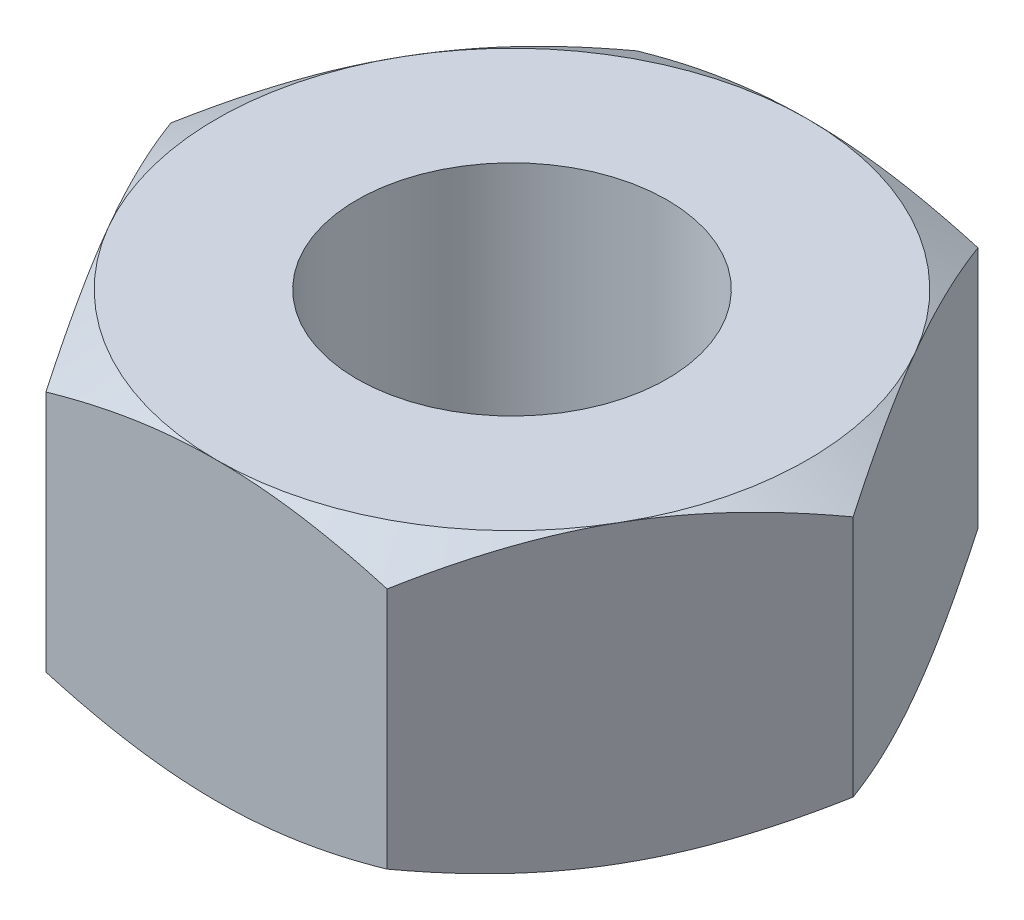
ISO-10303-21;
HEADER;
FILE_DESCRIPTION(('STEP AP214'),'2;1');
FILE_NAME('part.step','',(''),(''),'','','');
FILE_SCHEMA(('AUTOMOTIVE_DESIGN { 1 0 10303 214 1 1 1 1 }'));
ENDSEC;
DATA;
#1=APPLICATION_CONTEXT('core data for automotive mechanical design processes');
#2=APPLICATION_PROTOCOL_DEFINITION('international standard','automotive_design',2000,#1);
#3=PRODUCT_CONTEXT('',#1,'mechanical');
#4=PRODUCT('Part','Part','',(#3));
#5=PRODUCT_RELATED_PRODUCT_CATEGORY('part','',(#4));
#6=PRODUCT_DEFINITION_FORMATION('','',#4);
#7=PRODUCT_DEFINITION_CONTEXT('part definition',#1,'design');
#8=PRODUCT_DEFINITION('design','',#6,#7);
#9=PRODUCT_DEFINITION_SHAPE('','',#8);
#10=(LENGTH_UNIT() NAMED_UNIT(*) SI_UNIT(.MILLI.,.METRE.));
#11=(NAMED_UNIT(*) PLANE_ANGLE_UNIT() SI_UNIT($,.RADIAN.));
#12=(NAMED_UNIT(*) SI_UNIT($,.STERADIAN.) SOLID_ANGLE_UNIT());
#13=UNCERTAINTY_MEASURE_WITH_UNIT(LENGTH_MEASURE(1.E-05),#10,'distance_accuracy_value','');
#14=(GEOMETRIC_REPRESENTATION_CONTEXT(3) GLOBAL_UNCERTAINTY_ASSIGNED_CONTEXT((#13)) GLOBAL_UNIT_ASSIGNED_CONTEXT((#10,
#11,#12)) REPRESENTATION_CONTEXT('',''));
#15=CARTESIAN_POINT('',(0.,0.,0.));
#16=DIRECTION('',(0.,0.,1.));
#17=DIRECTION('',(1.,0.,0.));
#18=AXIS2_PLACEMENT_3D('',#15,#16,#17);
#19=CARTESIAN_POINT('',(0.,0.,0.));
#20=DIRECTION('',(0.,1.,0.));
#21=DIRECTION('',(0.,0.,1.));
#22=AXIS2_PLACEMENT_3D('',#19,#20,#21);
#23=PLANE('',#22);
#24=CARTESIAN_POINT('',(0.,0.,0.));
#25=DIRECTION('',(0.,1.,0.));
#26=DIRECTION('',(0.,0.,1.));
#27=AXIS2_PLACEMENT_3D('',#24,#25,#26);
#28=CIRCLE('',#27,2.1);
#29=CARTESIAN_POINT('',(0.,0.,2.1));
#30=VERTEX_POINT('',#29);
#31=EDGE_CURVE('E151',#30,#30,#28,.T.);
#32=ORIENTED_EDGE('',*,*,#31,.T.);
#33=EDGE_LOOP('',(#32));
#34=FACE_BOUND('',#33,.T.);
#35=CARTESIAN_POINT('',(0.,0.,0.));
#36=DIRECTION('',(0.,1.,0.));
#37=DIRECTION('',(0.,0.,1.));
#38=AXIS2_PLACEMENT_3D('',#35,#36,#37);
#39=CIRCLE('',#38,4.);
#40=CARTESIAN_POINT('',(3.46410161513776,0.,2.));
#41=VERTEX_POINT('',#40);
#42=CARTESIAN_POINT('',(0.,0.,4.));
#43=VERTEX_POINT('',#42);
#44=EDGE_CURVE('E280',#41,#43,#39,.F.);
#45=ORIENTED_EDGE('',*,*,#44,.T.);
#46=CARTESIAN_POINT('',(-3.46410161513775,0.,2.));
#47=VERTEX_POINT('',#46);
#48=EDGE_CURVE('E279',#43,#47,#39,.F.);
#49=ORIENTED_EDGE('',*,*,#48,.T.);
#50=CARTESIAN_POINT('',(-3.46410161513776,0.,-2.));
#51=VERTEX_POINT('',#50);
#52=EDGE_CURVE('E156',#47,#51,#39,.F.);
#53=ORIENTED_EDGE('',*,*,#52,.T.);
#54=CARTESIAN_POINT('',(0.,0.,-4.));
#55=VERTEX_POINT('',#54);
#56=EDGE_CURVE('E130',#51,#55,#39,.F.);
#57=ORIENTED_EDGE('',*,*,#56,.T.);
#58=CARTESIAN_POINT('',(0.,0.,0.));
#59=DIRECTION('',(0.,-1.,0.));
#60=DIRECTION('',(0.,0.,-1.));
#61=AXIS2_PLACEMENT_3D('',#58,#59,#60);
#62=CIRCLE('',#61,4.);
#63=CARTESIAN_POINT('',(3.46410161513775,0.,-2.));
#64=VERTEX_POINT('',#63);
#65=EDGE_CURVE('E142',#55,#64,#62,.T.);
#66=ORIENTED_EDGE('',*,*,#65,.T.);
#67=EDGE_CURVE('E157',#64,#41,#39,.F.);
#68=ORIENTED_EDGE('',*,*,#67,.T.);
#69=EDGE_LOOP('',(#45,#49,#53,#57,#66,#68));
#70=FACE_BOUND('',#69,.T.);
#71=ADVANCED_FACE('F35',(#34,#70),#23,.F.);
#72=CARTESIAN_POINT('',(0.,1.01165529752684,0.));
#73=DIRECTION('',(0.,1.,0.));
#74=DIRECTION('',(0.,0.,1.));
#75=AXIS2_PLACEMENT_3D('',#72,#73,#74);
#76=CONICAL_SURFACE('',#75,5.75223837506273,1.0471975511966);
#77=ORIENTED_EDGE('',*,*,#44,.F.);
#78=CARTESIAN_POINT('',(2.30928560670466,0.357332259074763,4.0002));
#79=CARTESIAN_POINT('',(2.4107717464617,0.298717873648279,3.82442084967677));
#80=CARTESIAN_POINT('',(2.51313390883499,0.245410321462259,3.64712438367362));
#81=CARTESIAN_POINT('',(2.71963072479811,0.152361670746401,3.28946140682429));
#82=CARTESIAN_POINT('',(2.82376904741904,0.112653489029702,3.10908854102985));
#83=CARTESIAN_POINT('',(3.03075510011795,0.0508422152802777,2.75057818129721));
#84=CARTESIAN_POINT('',(3.13357098372491,0.0283277315228874,2.57249584706486));
#85=CARTESIAN_POINT('',(3.33968651028528,0.00145062314658053,2.21549328283349));
#86=CARTESIAN_POINT('',(3.44298540411434,-0.0029342585730579,2.0365743503559));
#87=CARTESIAN_POINT('',(3.63600352522932,0.00619007293996886,1.70225715780327));
#88=CARTESIAN_POINT('',(3.72575165335064,0.0174589539879925,1.54680884001294));
#89=CARTESIAN_POINT('',(3.90466320392054,0.0531739907981907,1.23692494436495));
#90=CARTESIAN_POINT('',(3.99382600759478,0.0776323457115302,1.08249043825587));
#91=CARTESIAN_POINT('',(4.17310641015197,0.138776064919286,0.771967672225422));
#92=CARTESIAN_POINT('',(4.26320131938131,0.17572060365486,0.615918711936897));
#93=CARTESIAN_POINT('',(4.4420474282755,0.259570072548023,0.30614816459616));
#94=CARTESIAN_POINT('',(4.53080091904966,0.306455302212736,0.15242260922622));
#95=CARTESIAN_POINT('',(4.61891762357084,0.357332259074762,-0.000200000000000818));
#96=B_SPLINE_CURVE_WITH_KNOTS('',3,(#78,#79,#80,#81,#82,#83,#84,#85,#86,#87,#88,#89,#90,#91,#92,
#93,#94,#95),.UNSPECIFIED.,.F.,.F.,(4,2,2,2,2,2,2,2,4),(0.,0.634047835695965,1.26961969224543,
1.88946157213122,2.50854226669297,3.04757825393385,3.58711366126903,4.13861653143764,
4.68903648037743),.UNSPECIFIED.);
#97=CARTESIAN_POINT('',(2.3094010767585,0.357265589908158,4.));
#98=VERTEX_POINT('',#97);
#99=EDGE_CURVE('E257',#98,#41,#96,.T.);
#100=ORIENTED_EDGE('',*,*,#99,.F.);
#101=CARTESIAN_POINT('',(-6.21610382945253,1.95830505255475,4.));
#102=CARTESIAN_POINT('',(-6.04129393753383,1.87345531470294,4.));
#103=CARTESIAN_POINT('',(-5.866084134719,1.78941544477169,4.));
#104=CARTESIAN_POINT('',(-5.51465209675861,1.62341065326267,4.));
#105=CARTESIAN_POINT('',(-5.33842970851649,1.54144605615205,4.));
#106=CARTESIAN_POINT('',(-4.98385801778069,1.37963737506261,4.));
#107=CARTESIAN_POINT('',(-4.8055023669303,1.29980715444459,4.));
#108=CARTESIAN_POINT('',(-4.44737699770602,1.14339646321227,4.));
#109=CARTESIAN_POINT('',(-4.26760734622888,1.06681583994185,4.));
#110=CARTESIAN_POINT('',(-3.90050810678963,0.915343870654523,4.));
#111=CARTESIAN_POINT('',(-3.71312239199081,0.840587811222979,4.));
#112=CARTESIAN_POINT('',(-3.3361633261642,0.696702657851749,4.));
#113=CARTESIAN_POINT('',(-3.14658973299501,0.62757419369362,4.));
#114=CARTESIAN_POINT('',(-2.76530411727324,0.496749654124006,4.));
#115=CARTESIAN_POINT('',(-2.57359727178235,0.435038641169028,4.));
#116=CARTESIAN_POINT('',(-2.18743348201238,0.321020872537668,4.));
#117=CARTESIAN_POINT('',(-1.99297742073436,0.268711168154121,4.));
#118=CARTESIAN_POINT('',(-1.60229161070312,0.176278338862026,4.));
#119=CARTESIAN_POINT('',(-1.40607796776608,0.136088389516055,4.));
#120=CARTESIAN_POINT('',(-1.01119696707465,0.0701558498648354,4.));
#121=CARTESIAN_POINT('',(-0.812529846459926,0.0444118742889818,4.));
#122=CARTESIAN_POINT('',(-0.416334271672849,0.00976143621869423,4.));
#123=CARTESIAN_POINT('',(-0.218825312568516,0.00063755988438352,4.));
#124=CARTESIAN_POINT('',(0.17626120125344,-0.000572186093219584,4.));
#125=CARTESIAN_POINT('',(0.373838757050768,0.00734222584564285,4.));
#126=CARTESIAN_POINT('',(0.70889189743754,0.0346497891926858,4.));
#127=CARTESIAN_POINT('',(0.846724424757143,0.0499172637070026,4.));
#128=CARTESIAN_POINT('',(1.12138280851754,0.0878005320879427,4.));
#129=CARTESIAN_POINT('',(1.25820852697945,0.110417314648067,4.));
#130=CARTESIAN_POINT('',(1.6669925458922,0.188103177465333,4.));
#131=CARTESIAN_POINT('',(1.93710530269367,0.252993698033655,4.));
#132=CARTESIAN_POINT('',(2.34100258449655,0.365542277663182,4.));
#133=CARTESIAN_POINT('',(2.47688023904443,0.406116926927529,4.));
#134=CARTESIAN_POINT('',(2.7473156995193,0.491487455346763,4.));
#135=CARTESIAN_POINT('',(2.88187349674704,0.53628336230362,4.));
#136=CARTESIAN_POINT('',(3.14971162021589,0.629376977397762,4.));
#137=CARTESIAN_POINT('',(3.28299235003583,0.677673534961568,4.));
#138=CARTESIAN_POINT('',(3.54844920627366,0.777199578240249,4.));
#139=CARTESIAN_POINT('',(3.68062534546055,0.828429029997131,4.));
#140=CARTESIAN_POINT('',(3.99176962227722,0.952363485660557,4.));
#141=CARTESIAN_POINT('',(4.17031907349587,1.0261176679972,4.));
#142=CARTESIAN_POINT('',(4.52590076029498,1.17720690942518,4.));
#143=CARTESIAN_POINT('',(4.7029329041339,1.25454218325646,4.));
#144=CARTESIAN_POINT('',(5.05575838858236,1.41207616475093,4.));
#145=CARTESIAN_POINT('',(5.23155146986776,1.49227545169641,4.));
#146=CARTESIAN_POINT('',(5.5820735849472,1.65497001304965,4.));
#147=CARTESIAN_POINT('',(5.75680259574338,1.73746533686873,4.));
#148=CARTESIAN_POINT('',(6.28000491494065,1.98789188019563,4.));
#149=CARTESIAN_POINT('',(6.62714536888524,2.15860603665389,4.));
#150=CARTESIAN_POINT('',(7.31891008279937,2.50505668842854,4.));
#151=CARTESIAN_POINT('',(7.66353424898847,2.6807933697438,4.));
#152=CARTESIAN_POINT('',(8.32215325819648,3.02096699537072,4.));
#153=CARTESIAN_POINT('',(8.63629620049669,3.18511773748744,4.));
#154=CARTESIAN_POINT('',(9.26340755269146,3.51567071485497,4.));
#155=CARTESIAN_POINT('',(9.57637592053283,3.68207302975468,4.));
#156=CARTESIAN_POINT('',(10.2006123381608,4.01617620516382,4.));
#157=CARTESIAN_POINT('',(10.5118826823662,4.18387278436308,4.));
#158=CARTESIAN_POINT('',(11.1336717290461,4.52061326666315,4.));
#159=CARTESIAN_POINT('',(11.4441904722528,4.6896570945188,4.));
#160=CARTESIAN_POINT('',(11.7544324444447,4.85920367105242,4.));
#161=B_SPLINE_CURVE_WITH_KNOTS('',3,(#101,#102,#103,#104,#105,#106,#107,#108,#109,#110,#111,
#112,#113,#114,#115,#116,#117,#118,#119,#120,#121,#122,#123,#124,#125,#126,#127,#128,#129,#130,
#131,#132,#133,#134,#135,#136,#137,#138,#139,#140,#141,#142,#143,#144,#145,#146,#147,#148,#149,
#150,#151,#152,#153,#154,#155,#156,#157,#158,#159,#160),.UNSPECIFIED.,.F.,.F.,(4,2,2,2,2,2,2,2,
2,2,2,2,2,2,2,2,2,2,2,2,2,2,2,2,2,2,2,2,2,4),(0.,0.582949414006017,1.1659894157665,
1.75218219754288,2.33834741122659,2.94351871374663,3.54875764787039,4.15275654833507,
4.75656567352277,5.35698201449384,5.95734076977911,6.54978800544378,7.14224503222404,
7.55807008352397,7.97395109843927,8.80617021055455,9.23155305928882,9.65693870986772,
10.0821851756723,10.5074267188319,11.0869224481941,11.6664529720976,12.2461013846533,
12.8257622810584,13.9862303010348,15.1467413523853,16.2100642679783,17.2734248972432,
18.3341296550054,19.394775580824),.UNSPECIFIED.);
#162=EDGE_CURVE('E251',#43,#98,#161,.T.);
#163=ORIENTED_EDGE('',*,*,#162,.F.);
#164=EDGE_LOOP('',(#77,#100,#163));
#165=FACE_BOUND('',#164,.T.);
#166=ADVANCED_FACE('F283',(#165),#76,.T.);
#167=ORIENTED_EDGE('',*,*,#67,.F.);
#168=CARTESIAN_POINT('',(4.61891762357084,0.357332259074762,0.00019999999999875));
#169=CARTESIAN_POINT('',(4.5174314838138,0.298717873648278,-0.175579150323229));
#170=CARTESIAN_POINT('',(4.41506932144051,0.245410321462259,-0.352875616326382));
#171=CARTESIAN_POINT('',(4.20857250547739,0.152361670746401,-0.710538593175707));
#172=CARTESIAN_POINT('',(4.10443418285647,0.112653489029702,-0.890911458970151));
#173=CARTESIAN_POINT('',(3.89744813015756,0.0508422152802777,-1.24942181870279));
#174=CARTESIAN_POINT('',(3.79463224655059,0.0283277315228878,-1.42750415293514));
#175=CARTESIAN_POINT('',(3.58851671999023,0.00145062314658105,-1.78450671716651));
#176=CARTESIAN_POINT('',(3.48521782616117,-0.00293425857305755,-1.9634256496441));
#177=CARTESIAN_POINT('',(3.29219970504619,0.00619007293996924,-2.29774284219673));
#178=CARTESIAN_POINT('',(3.20245157692486,0.017458953987993,-2.45319115998706));
#179=CARTESIAN_POINT('',(3.02354002635497,0.0531739907981915,-2.76307505563505));
#180=CARTESIAN_POINT('',(2.93437722268072,0.0776323457115311,-2.91750956174413));
#181=CARTESIAN_POINT('',(2.75509682012354,0.138776064919287,-3.22803232777458));
#182=CARTESIAN_POINT('',(2.6650019108942,0.17572060365486,-3.3840812880631));
#183=CARTESIAN_POINT('',(2.48615580200001,0.259570072548023,-3.69385183540384));
#184=CARTESIAN_POINT('',(2.39740231122585,0.306455302212736,-3.84757739077378));
#185=CARTESIAN_POINT('',(2.30928560670466,0.357332259074763,-4.0002));
#186=B_SPLINE_CURVE_WITH_KNOTS('',3,(#168,#169,#170,#171,#172,#173,#174,#175,#176,#177,#178,
#179,#180,#181,#182,#183,#184,#185),.UNSPECIFIED.,.F.,.F.,(4,2,2,2,2,2,2,2,4),(0.,
0.634047835695965,1.26961969224543,1.88946157213122,2.50854226669297,3.04757825393385,
3.58711366126903,4.13861653143763,4.68903648037743),.UNSPECIFIED.);
#187=CARTESIAN_POINT('',(4.618802153517,0.357265589908158,0.));
#188=VERTEX_POINT('',#187);
#189=EDGE_CURVE('E163',#188,#64,#186,.T.);
#190=ORIENTED_EDGE('',*,*,#189,.F.);
#191=EDGE_CURVE('E258',#41,#188,#96,.T.);
#192=ORIENTED_EDGE('',*,*,#191,.F.);
#193=EDGE_LOOP('',(#167,#190,#192));
#194=FACE_BOUND('',#193,.T.);
#195=ADVANCED_FACE('F351',(#194),#76,.T.);
#196=ORIENTED_EDGE('',*,*,#65,.F.);
#197=CARTESIAN_POINT('',(-6.21610382945253,1.95830505255475,-4.));
#198=CARTESIAN_POINT('',(-6.04129393753383,1.87345531470294,-4.));
#199=CARTESIAN_POINT('',(-5.866084134719,1.78941544477169,-4.));
#200=CARTESIAN_POINT('',(-5.51465209675861,1.62341065326267,-4.));
#201=CARTESIAN_POINT('',(-5.33842970851649,1.54144605615205,-4.));
#202=CARTESIAN_POINT('',(-4.98385801778069,1.37963737506261,-4.));
#203=CARTESIAN_POINT('',(-4.8055023669303,1.29980715444459,-4.));
#204=CARTESIAN_POINT('',(-4.44737699770602,1.14339646321227,-4.));
#205=CARTESIAN_POINT('',(-4.26760734622888,1.06681583994185,-4.));
#206=CARTESIAN_POINT('',(-3.90050810678963,0.915343870654523,-4.));
#207=CARTESIAN_POINT('',(-3.71312239199081,0.840587811222979,-4.));
#208=CARTESIAN_POINT('',(-3.3361633261642,0.696702657851749,-4.));
#209=CARTESIAN_POINT('',(-3.14658973299501,0.62757419369362,-4.));
#210=CARTESIAN_POINT('',(-2.76530411727324,0.496749654124006,-4.));
#211=CARTESIAN_POINT('',(-2.57359727178235,0.435038641169028,-4.));
#212=CARTESIAN_POINT('',(-2.18743348201238,0.321020872537668,-4.));
#213=CARTESIAN_POINT('',(-1.99297742073436,0.268711168154121,-4.));
#214=CARTESIAN_POINT('',(-1.60229161070312,0.176278338862026,-4.));
#215=CARTESIAN_POINT('',(-1.40607796776608,0.136088389516055,-4.));
#216=CARTESIAN_POINT('',(-1.01119696707465,0.0701558498648354,-4.));
#217=CARTESIAN_POINT('',(-0.812529846459926,0.0444118742889818,-4.));
#218=CARTESIAN_POINT('',(-0.416334271672849,0.00976143621869424,-4.));
#219=CARTESIAN_POINT('',(-0.218825312568516,0.000637559884383533,-4.));
#220=CARTESIAN_POINT('',(0.17626120125344,-0.000572186093219575,-4.));
#221=CARTESIAN_POINT('',(0.373838757050768,0.00734222584564286,-4.));
#222=CARTESIAN_POINT('',(0.70889189743754,0.0346497891926858,-4.));
#223=CARTESIAN_POINT('',(0.846724424757143,0.0499172637070026,-4.));
#224=CARTESIAN_POINT('',(1.12138280851754,0.0878005320879427,-4.));
#225=CARTESIAN_POINT('',(1.25820852697945,0.110417314648067,-4.));
#226=CARTESIAN_POINT('',(1.6669925458922,0.188103177465333,-4.));
#227=CARTESIAN_POINT('',(1.93710530269367,0.252993698033655,-4.));
#228=CARTESIAN_POINT('',(2.34100258449655,0.365542277663182,-4.));
#229=CARTESIAN_POINT('',(2.47688023904443,0.406116926927529,-4.));
#230=CARTESIAN_POINT('',(2.7473156995193,0.491487455346763,-4.));
#231=CARTESIAN_POINT('',(2.88187349674704,0.53628336230362,-4.));
#232=CARTESIAN_POINT('',(3.14971162021589,0.629376977397762,-4.));
#233=CARTESIAN_POINT('',(3.28299235003583,0.677673534961568,-4.));
#234=CARTESIAN_POINT('',(3.54844920627366,0.777199578240249,-4.));
#235=CARTESIAN_POINT('',(3.68062534546055,0.828429029997131,-4.));
#236=CARTESIAN_POINT('',(3.99176962227722,0.952363485660557,-4.));
#237=CARTESIAN_POINT('',(4.17031907349587,1.0261176679972,-4.));
#238=CARTESIAN_POINT('',(4.52590076029498,1.17720690942518,-4.));
#239=CARTESIAN_POINT('',(4.7029329041339,1.25454218325646,-4.));
#240=CARTESIAN_POINT('',(5.05575838858236,1.41207616475093,-4.));
#241=CARTESIAN_POINT('',(5.23155146986776,1.49227545169641,-4.));
#242=CARTESIAN_POINT('',(5.5820735849472,1.65497001304965,-4.));
#243=CARTESIAN_POINT('',(5.75680259574338,1.73746533686873,-4.));
#244=CARTESIAN_POINT('',(6.28000491494065,1.98789188019563,-4.));
#245=CARTESIAN_POINT('',(6.62714536888524,2.15860603665389,-4.));
#246=CARTESIAN_POINT('',(7.31891008279937,2.50505668842854,-4.));
#247=CARTESIAN_POINT('',(7.66353424898847,2.6807933697438,-4.));
#248=CARTESIAN_POINT('',(8.32215325819648,3.02096699537072,-4.));
#249=CARTESIAN_POINT('',(8.63629620049669,3.18511773748743,-4.));
#250=CARTESIAN_POINT('',(9.26340755269146,3.51567071485497,-4.));
#251=CARTESIAN_POINT('',(9.57637592053283,3.68207302975468,-4.));
#252=CARTESIAN_POINT('',(10.2006123381608,4.01617620516382,-4.));
#253=CARTESIAN_POINT('',(10.5118826823662,4.18387278436307,-4.));
#254=CARTESIAN_POINT('',(11.1336717290461,4.52061326666314,-4.));
#255=CARTESIAN_POINT('',(11.4441904722528,4.6896570945188,-4.));
#256=CARTESIAN_POINT('',(11.7544324444447,4.85920367105242,-4.));
#257=B_SPLINE_CURVE_WITH_KNOTS('',3,(#197,#198,#199,#200,#201,#202,#203,#204,#205,#206,#207,
#208,#209,#210,#211,#212,#213,#214,#215,#216,#217,#218,#219,#220,#221,#222,#223,#224,#225,#226,
#227,#228,#229,#230,#231,#232,#233,#234,#235,#236,#237,#238,#239,#240,#241,#242,#243,#244,#245,
#246,#247,#248,#249,#250,#251,#252,#253,#254,#255,#256),.UNSPECIFIED.,.F.,.F.,(4,2,2,2,2,2,2,2,
2,2,2,2,2,2,2,2,2,2,2,2,2,2,2,2,2,2,2,2,2,4),(0.,0.582949414006017,1.1659894157665,
1.75218219754288,2.33834741122659,2.94351871374663,3.54875764787039,4.15275654833507,
4.75656567352277,5.35698201449384,5.95734076977911,6.54978800544378,7.14224503222404,
7.55807008352397,7.97395109843927,8.80617021055455,9.23155305928882,9.65693870986772,
10.0821851756723,10.5074267188319,11.0869224481941,11.6664529720976,12.2461013846533,
12.8257622810584,13.9862303010348,15.1467413523853,16.2100642679783,17.2734248972432,
18.3341296550054,19.394775580824),.UNSPECIFIED.);
#258=CARTESIAN_POINT('',(2.3094010767585,0.357265589908158,-4.));
#259=VERTEX_POINT('',#258);
#260=EDGE_CURVE('E138',#259,#55,#257,.F.);
#261=ORIENTED_EDGE('',*,*,#260,.F.);
#262=EDGE_CURVE('E145',#64,#259,#186,.T.);
#263=ORIENTED_EDGE('',*,*,#262,.F.);
#264=EDGE_LOOP('',(#196,#261,#263));
#265=FACE_BOUND('',#264,.T.);
#266=ADVANCED_FACE('F143',(#265),#76,.T.);
#267=ORIENTED_EDGE('',*,*,#56,.F.);
#268=CARTESIAN_POINT('',(-2.30928560670466,0.357332259074763,-4.0002));
#269=CARTESIAN_POINT('',(-2.4107717464617,0.298717873648279,-3.82442084967677));
#270=CARTESIAN_POINT('',(-2.51313390883499,0.245410321462259,-3.64712438367362));
#271=CARTESIAN_POINT('',(-2.71963072479811,0.152361670746401,-3.28946140682429));
#272=CARTESIAN_POINT('',(-2.82376904741904,0.112653489029702,-3.10908854102985));
#273=CARTESIAN_POINT('',(-3.03075510011795,0.0508422152802777,-2.75057818129721));
#274=CARTESIAN_POINT('',(-3.13357098372491,0.0283277315228874,-2.57249584706486));
#275=CARTESIAN_POINT('',(-3.33968651028528,0.00145062314658052,-2.21549328283349));
#276=CARTESIAN_POINT('',(-3.44298540411434,-0.00293425857305787,-2.0365743503559));
#277=CARTESIAN_POINT('',(-3.63600352522932,0.00619007293996884,-1.70225715780327));
#278=CARTESIAN_POINT('',(-3.72575165335064,0.0174589539879924,-1.54680884001294));
#279=CARTESIAN_POINT('',(-3.90466320392054,0.0531739907981906,-1.23692494436495));
#280=CARTESIAN_POINT('',(-3.99382600759478,0.0776323457115302,-1.08249043825587));
#281=CARTESIAN_POINT('',(-4.17310641015197,0.138776064919286,-0.771967672225423));
#282=CARTESIAN_POINT('',(-4.26320131938131,0.17572060365486,-0.615918711936898));
#283=CARTESIAN_POINT('',(-4.4420474282755,0.259570072548023,-0.306148164596161));
#284=CARTESIAN_POINT('',(-4.53080091904966,0.306455302212735,-0.152422609226221));
#285=CARTESIAN_POINT('',(-4.61891762357084,0.357332259074762,0.000199999999999958));
#286=B_SPLINE_CURVE_WITH_KNOTS('',3,(#268,#269,#270,#271,#272,#273,#274,#275,#276,#277,#278,
#279,#280,#281,#282,#283,#284,#285),.UNSPECIFIED.,.F.,.F.,(4,2,2,2,2,2,2,2,4),(0.,
0.634047835695965,1.26961969224543,1.88946157213122,2.50854226669297,3.04757825393385,
3.58711366126903,4.13861653143763,4.68903648037743),.UNSPECIFIED.);
#287=CARTESIAN_POINT('',(-2.3094010767585,0.357265589908158,-4.));
#288=VERTEX_POINT('',#287);
#289=EDGE_CURVE('E133',#288,#51,#286,.T.);
#290=ORIENTED_EDGE('',*,*,#289,.F.);
#291=EDGE_CURVE('E126',#55,#288,#257,.F.);
#292=ORIENTED_EDGE('',*,*,#291,.F.);
#293=EDGE_LOOP('',(#267,#290,#292));
#294=FACE_BOUND('',#293,.T.);
#295=ADVANCED_FACE('F128',(#294),#76,.T.);
#296=CARTESIAN_POINT('',(-4.618802153517,0.357265589908158,0.));
#297=VERTEX_POINT('',#296);
#298=EDGE_CURVE('E171',#51,#297,#286,.T.);
#299=ORIENTED_EDGE('',*,*,#298,.F.);
#300=ORIENTED_EDGE('',*,*,#52,.F.);
#301=CARTESIAN_POINT('',(-4.61891762357084,0.357332259074762,-0.000199999999999181));
#302=CARTESIAN_POINT('',(-4.5174314838138,0.298717873648279,0.175579150323229));
#303=CARTESIAN_POINT('',(-4.41506932144051,0.245410321462259,0.352875616326381));
#304=CARTESIAN_POINT('',(-4.20857250547739,0.152361670746401,0.710538593175706));
#305=CARTESIAN_POINT('',(-4.10443418285647,0.112653489029702,0.890911458970151));
#306=CARTESIAN_POINT('',(-3.89744813015756,0.0508422152802777,1.24942181870279));
#307=CARTESIAN_POINT('',(-3.79463224655059,0.0283277315228877,1.42750415293514));
#308=CARTESIAN_POINT('',(-3.58851671999023,0.00145062314658097,1.78450671716651));
#309=CARTESIAN_POINT('',(-3.48521782616117,-0.00293425857305751,1.9634256496441));
#310=CARTESIAN_POINT('',(-3.29219970504619,0.0061900729399694,2.29774284219673));
#311=CARTESIAN_POINT('',(-3.20245157692486,0.0174589539879932,2.45319115998706));
#312=CARTESIAN_POINT('',(-3.02354002635497,0.0531739907981915,2.76307505563505));
#313=CARTESIAN_POINT('',(-2.93437722268073,0.077632345711531,2.91750956174413));
#314=CARTESIAN_POINT('',(-2.75509682012354,0.138776064919287,3.22803232777458));
#315=CARTESIAN_POINT('',(-2.6650019108942,0.17572060365486,3.3840812880631));
#316=CARTESIAN_POINT('',(-2.48615580200001,0.259570072548023,3.69385183540384));
#317=CARTESIAN_POINT('',(-2.39740231122585,0.306455302212736,3.84757739077378));
#318=CARTESIAN_POINT('',(-2.30928560670466,0.357332259074762,4.0002));
#319=B_SPLINE_CURVE_WITH_KNOTS('',3,(#301,#302,#303,#304,#305,#306,#307,#308,#309,#310,#311,
#312,#313,#314,#315,#316,#317,#318),.UNSPECIFIED.,.F.,.F.,(4,2,2,2,2,2,2,2,4),(0.,
0.634047835695965,1.26961969224543,1.88946157213122,2.50854226669297,3.04757825393385,
3.58711366126903,4.13861653143763,4.68903648037743),.UNSPECIFIED.);
#320=EDGE_CURVE('E267',#297,#47,#319,.T.);
#321=ORIENTED_EDGE('',*,*,#320,.F.);
#322=EDGE_LOOP('',(#299,#300,#321));
#323=FACE_BOUND('',#322,.T.);
#324=ADVANCED_FACE('F181',(#323),#76,.T.);
#325=ORIENTED_EDGE('',*,*,#48,.F.);
#326=CARTESIAN_POINT('',(-2.30940107675904,0.357265589907797,4.));
#327=VERTEX_POINT('',#326);
#328=EDGE_CURVE('E256',#327,#43,#161,.T.);
#329=ORIENTED_EDGE('',*,*,#328,.F.);
#330=EDGE_CURVE('E262',#47,#327,#319,.T.);
#331=ORIENTED_EDGE('',*,*,#330,.F.);
#332=EDGE_LOOP('',(#325,#329,#331));
#333=FACE_BOUND('',#332,.T.);
#334=ADVANCED_FACE('F278',(#333),#76,.T.);
#335=CARTESIAN_POINT('',(-4.618802153517,4.,0.));
#336=DIRECTION('',(0.866025403784439,0.,-0.5));
#337=DIRECTION('',(-0.5,0.,-0.866025403784439));
#338=AXIS2_PLACEMENT_3D('',#335,#336,#337);
#339=PLANE('',#338);
#340=DIRECTION('',(0.,-1.,0.));
#341=VECTOR('',#340,1.);
#342=CARTESIAN_POINT('',(-2.3094010767585,4.,4.));
#343=LINE('',#342,#341);
#344=CARTESIAN_POINT('',(-2.3094010767585,3.64273441009184,4.));
#345=VERTEX_POINT('',#344);
#346=EDGE_CURVE('E276',#345,#327,#343,.T.);
#347=ORIENTED_EDGE('',*,*,#346,.F.);
#348=CARTESIAN_POINT('',(-2.30928560670466,3.64266774092524,4.0002));
#349=CARTESIAN_POINT('',(-2.4107717464617,3.70128212635172,3.82442084967677));
#350=CARTESIAN_POINT('',(-2.51313390883499,3.75458967853774,3.64712438367362));
#351=CARTESIAN_POINT('',(-2.71963072479811,3.8476383292536,3.28946140682429));
#352=CARTESIAN_POINT('',(-2.82376904741904,3.8873465109703,3.10908854102985));
#353=CARTESIAN_POINT('',(-3.03075510011795,3.94915778471972,2.75057818129721));
#354=CARTESIAN_POINT('',(-3.13357098372491,3.97167226847711,2.57249584706486));
#355=CARTESIAN_POINT('',(-3.33968651028528,3.99854937685342,2.21549328283349));
#356=CARTESIAN_POINT('',(-3.44298540411434,4.00293425857306,2.0365743503559));
#357=CARTESIAN_POINT('',(-3.63600352522932,3.99380992706003,1.70225715780327));
#358=CARTESIAN_POINT('',(-3.72575165335064,3.98254104601201,1.54680884001294));
#359=CARTESIAN_POINT('',(-3.90466320392054,3.94682600920181,1.23692494436495));
#360=CARTESIAN_POINT('',(-3.99382600759478,3.92236765428847,1.08249043825587));
#361=CARTESIAN_POINT('',(-4.17310641015197,3.86122393508071,0.771967672225423));
#362=CARTESIAN_POINT('',(-4.26320131938131,3.82427939634514,0.615918711936899));
#363=CARTESIAN_POINT('',(-4.4420474282755,3.74042992745198,0.306148164596162));
#364=CARTESIAN_POINT('',(-4.53080091904966,3.69354469778726,0.152422609226222));
#365=CARTESIAN_POINT('',(-4.61891762357084,3.64266774092524,-0.000199999999999226));
#366=B_SPLINE_CURVE_WITH_KNOTS('',3,(#348,#349,#350,#351,#352,#353,#354,#355,#356,#357,#358,
#359,#360,#361,#362,#363,#364,#365),.UNSPECIFIED.,.F.,.F.,(4,2,2,2,2,2,2,2,4),(0.,
0.634047835695966,1.26961969224543,1.88946157213122,2.50854226669297,3.04757825393385,
3.58711366126903,4.13861653143763,4.68903648037743),.UNSPECIFIED.);
#367=CARTESIAN_POINT('',(-3.46410161513775,4.,2.));
#368=VERTEX_POINT('',#367);
#369=EDGE_CURVE('E308',#345,#368,#366,.T.);
#370=ORIENTED_EDGE('',*,*,#369,.T.);
#371=CARTESIAN_POINT('',(-4.618802153517,3.64273441009184,0.));
#372=VERTEX_POINT('',#371);
#373=EDGE_CURVE('E52',#368,#372,#366,.T.);
#374=ORIENTED_EDGE('',*,*,#373,.T.);
#375=DIRECTION('',(0.,-1.,0.));
#376=VECTOR('',#375,1.);
#377=CARTESIAN_POINT('',(-4.618802153517,4.,0.));
#378=LINE('',#377,#376);
#379=EDGE_CURVE('E294',#372,#297,#378,.T.);
#380=ORIENTED_EDGE('',*,*,#379,.T.);
#381=ORIENTED_EDGE('',*,*,#320,.T.);
#382=ORIENTED_EDGE('',*,*,#330,.T.);
#383=EDGE_LOOP('',(#347,#370,#374,#380,#381,#382));
#384=FACE_BOUND('',#383,.T.);
#385=ADVANCED_FACE('F37',(#384),#339,.F.);
#386=CARTESIAN_POINT('',(-2.3094010767585,4.,4.));
#387=DIRECTION('',(0.,0.,-1.));
#388=DIRECTION('',(-1.,0.,0.));
#389=AXIS2_PLACEMENT_3D('',#386,#387,#388);
#390=PLANE('',#389);
#391=DIRECTION('',(0.,-1.,0.));
#392=VECTOR('',#391,1.);
#393=CARTESIAN_POINT('',(2.3094010767585,4.,4.));
#394=LINE('',#393,#392);
#395=CARTESIAN_POINT('',(2.3094010767585,3.64273441009184,4.));
#396=VERTEX_POINT('',#395);
#397=EDGE_CURVE('E285',#396,#98,#394,.T.);
#398=ORIENTED_EDGE('',*,*,#397,.F.);
#399=CARTESIAN_POINT('',(-6.24559162206515,2.02736827641668,4.));
#400=CARTESIAN_POINT('',(-6.07053072470974,2.11245754672313,4.));
#401=CARTESIAN_POINT('',(-5.89507248347885,2.19674310533894,4.));
#402=CARTESIAN_POINT('',(-5.5431501793354,2.36325562938496,4.));
#403=CARTESIAN_POINT('',(-5.36668596695165,2.44548227856087,4.));
#404=CARTESIAN_POINT('',(-5.01165145493025,2.60783051789407,4.));
#405=CARTESIAN_POINT('',(-4.83307494451207,2.68793857202682,4.));
#406=CARTESIAN_POINT('',(-4.47451635710505,2.844932547916,4.));
#407=CARTESIAN_POINT('',(-4.29453434575151,2.92181861908049,4.));
#408=CARTESIAN_POINT('',(-3.92689943014578,3.07399439893625,4.));
#409=CARTESIAN_POINT('',(-3.73918960970108,3.14914734601058,4.));
#410=CARTESIAN_POINT('',(-3.36158947801015,3.29386703994031,4.));
#411=CARTESIAN_POINT('',(-3.17169892702165,3.36343316574773,4.));
#412=CARTESIAN_POINT('',(-2.78977728546009,3.49518384774197,4.));
#413=CARTESIAN_POINT('',(-2.59775127723347,3.55738299084263,4.));
#414=CARTESIAN_POINT('',(-2.21094474266055,3.67243170678816,4.));
#415=CARTESIAN_POINT('',(-2.01616509120753,3.72528418024869,4.));
#416=CARTESIAN_POINT('',(-1.62483570564712,3.81884605269263,4.));
#417=CARTESIAN_POINT('',(-1.42830245636267,3.85962314349864,4.));
#418=CARTESIAN_POINT('',(-1.03274780636574,3.92676179688866,4.));
#419=CARTESIAN_POINT('',(-0.833726654878614,3.95312479175255,4.));
#420=CARTESIAN_POINT('',(-0.436806981088597,3.98898880616065,4.));
#421=CARTESIAN_POINT('',(-0.238928842480005,3.99870985150853,4.));
#422=CARTESIAN_POINT('',(0.156945971364149,4.00104762473598,4.));
#423=CARTESIAN_POINT('',(0.354942648071117,3.99366413570467,4.));
#424=CARTESIAN_POINT('',(0.689842719804897,3.96723588795238,4.));
#425=CARTESIAN_POINT('',(0.827099149156393,3.9523969765354,4.));
#426=CARTESIAN_POINT('',(1.10062876450089,3.91540054947087,4.));
#427=CARTESIAN_POINT('',(1.23690181910569,3.89324207370548,4.));
#428=CARTESIAN_POINT('',(1.64405300226765,3.81694961577272,4.));
#429=CARTESIAN_POINT('',(1.91311573549682,3.75301180336916,4.));
#430=CARTESIAN_POINT('',(2.31548446689272,3.6418700249766,4.));
#431=CARTESIAN_POINT('',(2.45086915477515,3.60176050466832,4.));
#432=CARTESIAN_POINT('',(2.72032405669936,3.51730713312694,4.));
#433=CARTESIAN_POINT('',(2.85439426188535,3.47296325338819,4.));
#434=CARTESIAN_POINT('',(3.12126124142953,3.38075842449949,4.));
#435=CARTESIAN_POINT('',(3.25405840338579,3.3328985869421,4.));
#436=CARTESIAN_POINT('',(3.51854800887852,3.23423168698405,4.));
#437=CARTESIAN_POINT('',(3.65024046670658,3.18342466277872,4.));
#438=CARTESIAN_POINT('',(3.96610088387847,3.05814899794923,4.));
#439=CARTESIAN_POINT('',(4.14978933252684,2.98247342975844,4.));
#440=CARTESIAN_POINT('',(4.51555428948132,2.8273106817426,4.));
#441=CARTESIAN_POINT('',(4.69763068818384,2.74782324506986,4.));
#442=CARTESIAN_POINT('',(5.06047595708749,2.5858194432875,4.));
#443=CARTESIAN_POINT('',(5.24124452669086,2.50330240675631,4.));
#444=CARTESIAN_POINT('',(5.60166215439352,2.33585482563923,4.));
#445=CARTESIAN_POINT('',(5.78131118662965,2.25092422554621,4.));
#446=CARTESIAN_POINT('',(6.31927610289824,1.99303540122209,4.));
#447=CARTESIAN_POINT('',(6.67619617452751,1.81716756420204,4.));
#448=CARTESIAN_POINT('',(7.38736461658736,1.46026170535785,4.));
#449=CARTESIAN_POINT('',(7.74161333400724,1.27922437016295,4.));
#450=CARTESIAN_POINT('',(8.41757712406193,0.929338536390675,4.));
#451=CARTESIAN_POINT('',(8.73944991451798,0.760794170233857,4.));
#452=CARTESIAN_POINT('',(9.38199994975548,0.421415466504805,4.));
#453=CARTESIAN_POINT('',(9.70267714752204,0.250581040068343,4.));
#454=CARTESIAN_POINT('',(10.3422514157212,-0.0923722545260915,4.));
#455=CARTESIAN_POINT('',(10.6611509510615,-0.264486531827423,4.));
#456=CARTESIAN_POINT('',(11.2981883896893,-0.610074921075563,4.));
#457=CARTESIAN_POINT('',(11.6163263366922,-0.783548952404437,4.));
#458=CARTESIAN_POINT('',(11.9341856647198,-0.957528294945422,4.));
#459=B_SPLINE_CURVE_WITH_KNOTS('',3,(#399,#400,#401,#402,#403,#404,#405,#406,#407,#408,#409,
#410,#411,#412,#413,#414,#415,#416,#417,#418,#419,#420,#421,#422,#423,#424,#425,#426,#427,#428,
#429,#430,#431,#432,#433,#434,#435,#436,#437,#438,#439,#440,#441,#442,#443,#444,#445,#446,#447,
#448,#449,#450,#451,#452,#453,#454,#455,#456,#457,#458),.UNSPECIFIED.,.F.,.F.,(4,2,2,2,2,2,2,2,
2,2,2,2,2,2,2,2,2,2,2,2,2,2,2,2,2,2,2,2,2,4),(0.,0.583940588917331,1.16797032926004,
1.75510904772266,2.3422205095089,2.94873767441889,3.55532216855797,4.16068477888577,
4.76585919196676,5.36757396449594,5.96922893579592,6.5628660771665,7.1565107467787,
7.57047934661219,7.98450226888327,8.81299010484813,9.23655689560299,9.66012653800414,
10.0835628377321,10.5069936509798,11.1029333124797,11.6989131855927,12.2950259469575,
12.891152428835,14.0847673827709,15.2782245277256,16.368204785481,17.4582274623218,
18.545367852982,19.6324442689135),.UNSPECIFIED.);
#460=CARTESIAN_POINT('',(0.,4.,4.));
#461=VERTEX_POINT('',#460);
#462=EDGE_CURVE('E237',#396,#461,#459,.F.);
#463=ORIENTED_EDGE('',*,*,#462,.T.);
#464=EDGE_CURVE('E232',#461,#345,#459,.F.);
#465=ORIENTED_EDGE('',*,*,#464,.T.);
#466=ORIENTED_EDGE('',*,*,#346,.T.);
#467=ORIENTED_EDGE('',*,*,#328,.T.);
#468=ORIENTED_EDGE('',*,*,#162,.T.);
#469=EDGE_LOOP('',(#398,#463,#465,#466,#467,#468));
#470=FACE_BOUND('',#469,.T.);
#471=ADVANCED_FACE('F243',(#470),#390,.F.);
#472=CARTESIAN_POINT('',(2.3094010767585,4.,4.));
#473=DIRECTION('',(-0.866025403784439,0.,-0.5));
#474=DIRECTION('',(-0.5,0.,0.866025403784439));
#475=AXIS2_PLACEMENT_3D('',#472,#473,#474);
#476=PLANE('',#475);
#477=DIRECTION('',(0.,-1.,0.));
#478=VECTOR('',#477,1.);
#479=CARTESIAN_POINT('',(4.618802153517,4.,0.));
#480=LINE('',#479,#478);
#481=CARTESIAN_POINT('',(4.618802153517,3.64273441009184,0.));
#482=VERTEX_POINT('',#481);
#483=EDGE_CURVE('E289',#482,#188,#480,.T.);
#484=ORIENTED_EDGE('',*,*,#483,.F.);
#485=CARTESIAN_POINT('',(4.61891762357084,3.64266774092524,-0.000200000000001289));
#486=CARTESIAN_POINT('',(4.5174314838138,3.70128212635172,0.175579150323226));
#487=CARTESIAN_POINT('',(4.41506932144052,3.75458967853774,0.352875616326379));
#488=CARTESIAN_POINT('',(4.20857250547739,3.8476383292536,0.710538593175704));
#489=CARTESIAN_POINT('',(4.10443418285647,3.8873465109703,0.890911458970149));
#490=CARTESIAN_POINT('',(3.89744813015756,3.94915778471972,1.24942181870279));
#491=CARTESIAN_POINT('',(3.79463224655059,3.97167226847711,1.42750415293514));
#492=CARTESIAN_POINT('',(3.58851671999023,3.99854937685342,1.78450671716651));
#493=CARTESIAN_POINT('',(3.48521782616117,4.00293425857306,1.9634256496441));
#494=CARTESIAN_POINT('',(3.29219970504619,3.99380992706003,2.29774284219673));
#495=CARTESIAN_POINT('',(3.20245157692486,3.98254104601201,2.45319115998706));
#496=CARTESIAN_POINT('',(3.02354002635497,3.94682600920181,2.76307505563505));
#497=CARTESIAN_POINT('',(2.93437722268073,3.92236765428847,2.91750956174413));
#498=CARTESIAN_POINT('',(2.75509682012354,3.86122393508071,3.22803232777458));
#499=CARTESIAN_POINT('',(2.6650019108942,3.82427939634514,3.3840812880631));
#500=CARTESIAN_POINT('',(2.48615580200001,3.74042992745198,3.69385183540384));
#501=CARTESIAN_POINT('',(2.39740231122585,3.69354469778726,3.84757739077378));
#502=CARTESIAN_POINT('',(2.30928560670466,3.64266774092524,4.0002));
#503=B_SPLINE_CURVE_WITH_KNOTS('',3,(#485,#486,#487,#488,#489,#490,#491,#492,#493,#494,#495,
#496,#497,#498,#499,#500,#501,#502),.UNSPECIFIED.,.F.,.F.,(4,2,2,2,2,2,2,2,4),(0.,
0.634047835695964,1.26961969224543,1.88946157213122,2.50854226669297,3.04757825393385,
3.58711366126903,4.13861653143764,4.68903648037743),.UNSPECIFIED.);
#504=CARTESIAN_POINT('',(3.46410161513776,4.,2.));
#505=VERTEX_POINT('',#504);
#506=EDGE_CURVE('E296',#482,#505,#503,.T.);
#507=ORIENTED_EDGE('',*,*,#506,.T.);
#508=EDGE_CURVE('E238',#505,#396,#503,.T.);
#509=ORIENTED_EDGE('',*,*,#508,.T.);
#510=ORIENTED_EDGE('',*,*,#397,.T.);
#511=ORIENTED_EDGE('',*,*,#99,.T.);
#512=ORIENTED_EDGE('',*,*,#191,.T.);
#513=EDGE_LOOP('',(#484,#507,#509,#510,#511,#512));
#514=FACE_BOUND('',#513,.T.);
#515=ADVANCED_FACE('F246',(#514),#476,.F.);
#516=CARTESIAN_POINT('',(4.618802153517,4.,0.));
#517=DIRECTION('',(-0.866025403784439,0.,0.5));
#518=DIRECTION('',(0.5,0.,0.866025403784439));
#519=AXIS2_PLACEMENT_3D('',#516,#517,#518);
#520=PLANE('',#519);
#521=DIRECTION('',(0.,-1.,0.));
#522=VECTOR('',#521,1.);
#523=CARTESIAN_POINT('',(2.3094010767585,4.,-4.));
#524=LINE('',#523,#522);
#525=CARTESIAN_POINT('',(2.3094010767585,3.64273441009184,-4.));
#526=VERTEX_POINT('',#525);
#527=EDGE_CURVE('E162',#526,#259,#524,.T.);
#528=ORIENTED_EDGE('',*,*,#527,.F.);
#529=CARTESIAN_POINT('',(2.30928560670466,3.64266774092524,-4.0002));
#530=CARTESIAN_POINT('',(2.4107717464617,3.70128212635172,-3.82442084967677));
#531=CARTESIAN_POINT('',(2.51313390883499,3.75458967853774,-3.64712438367362));
#532=CARTESIAN_POINT('',(2.71963072479811,3.8476383292536,-3.28946140682429));
#533=CARTESIAN_POINT('',(2.82376904741904,3.8873465109703,-3.10908854102985));
#534=CARTESIAN_POINT('',(3.03075510011795,3.94915778471972,-2.75057818129721));
#535=CARTESIAN_POINT('',(3.13357098372492,3.97167226847711,-2.57249584706486));
#536=CARTESIAN_POINT('',(3.33968651028528,3.99854937685342,-2.21549328283349));
#537=CARTESIAN_POINT('',(3.44298540411434,4.00293425857306,-2.0365743503559));
#538=CARTESIAN_POINT('',(3.63600352522932,3.99380992706003,-1.70225715780327));
#539=CARTESIAN_POINT('',(3.72575165335064,3.98254104601201,-1.54680884001294));
#540=CARTESIAN_POINT('',(3.90466320392054,3.94682600920181,-1.23692494436495));
#541=CARTESIAN_POINT('',(3.99382600759478,3.92236765428847,-1.08249043825587));
#542=CARTESIAN_POINT('',(4.17310641015197,3.86122393508071,-0.771967672225424));
#543=CARTESIAN_POINT('',(4.26320131938131,3.82427939634514,-0.6159187119369));
#544=CARTESIAN_POINT('',(4.4420474282755,3.74042992745198,-0.306148164596162));
#545=CARTESIAN_POINT('',(4.53080091904966,3.69354469778726,-0.152422609226222));
#546=CARTESIAN_POINT('',(4.61891762357084,3.64266774092524,0.000199999999998546));
#547=B_SPLINE_CURVE_WITH_KNOTS('',3,(#529,#530,#531,#532,#533,#534,#535,#536,#537,#538,#539,
#540,#541,#542,#543,#544,#545,#546),.UNSPECIFIED.,.F.,.F.,(4,2,2,2,2,2,2,2,4),(0.,
0.634047835695965,1.26961969224543,1.88946157213122,2.50854226669297,3.04757825393385,
3.58711366126903,4.13861653143763,4.68903648037743),.UNSPECIFIED.);
#548=CARTESIAN_POINT('',(3.46410161513775,4.,-2.));
#549=VERTEX_POINT('',#548);
#550=EDGE_CURVE('E227',#526,#549,#547,.T.);
#551=ORIENTED_EDGE('',*,*,#550,.T.);
#552=EDGE_CURVE('E302',#549,#482,#547,.T.);
#553=ORIENTED_EDGE('',*,*,#552,.T.);
#554=ORIENTED_EDGE('',*,*,#483,.T.);
#555=ORIENTED_EDGE('',*,*,#189,.T.);
#556=ORIENTED_EDGE('',*,*,#262,.T.);
#557=EDGE_LOOP('',(#528,#551,#553,#554,#555,#556));
#558=FACE_BOUND('',#557,.T.);
#559=ADVANCED_FACE('F188',(#558),#520,.F.);
#560=CARTESIAN_POINT('',(2.3094010767585,4.,-4.));
#561=DIRECTION('',(0.,0.,1.));
#562=DIRECTION('',(1.,0.,0.));
#563=AXIS2_PLACEMENT_3D('',#560,#561,#562);
#564=PLANE('',#563);
#565=DIRECTION('',(0.,-1.,0.));
#566=VECTOR('',#565,1.);
#567=CARTESIAN_POINT('',(-2.3094010767585,4.,-4.));
#568=LINE('',#567,#566);
#569=CARTESIAN_POINT('',(-2.3094010767585,3.64273441009184,-4.));
#570=VERTEX_POINT('',#569);
#571=EDGE_CURVE('E293',#570,#288,#568,.T.);
#572=ORIENTED_EDGE('',*,*,#571,.F.);
#573=CARTESIAN_POINT('',(-6.24559162206515,2.02736827641668,-4.));
#574=CARTESIAN_POINT('',(-6.07053072470974,2.11245754672313,-4.));
#575=CARTESIAN_POINT('',(-5.89507248347885,2.19674310533894,-4.));
#576=CARTESIAN_POINT('',(-5.5431501793354,2.36325562938496,-4.));
#577=CARTESIAN_POINT('',(-5.36668596695165,2.44548227856087,-4.));
#578=CARTESIAN_POINT('',(-5.01165145493025,2.60783051789407,-4.));
#579=CARTESIAN_POINT('',(-4.83307494451207,2.68793857202682,-4.));
#580=CARTESIAN_POINT('',(-4.47451635710505,2.844932547916,-4.));
#581=CARTESIAN_POINT('',(-4.29453434575151,2.92181861908049,-4.));
#582=CARTESIAN_POINT('',(-3.92689943014578,3.07399439893625,-4.));
#583=CARTESIAN_POINT('',(-3.73918960970108,3.14914734601058,-4.));
#584=CARTESIAN_POINT('',(-3.36158947801015,3.29386703994031,-4.));
#585=CARTESIAN_POINT('',(-3.17169892702165,3.36343316574773,-4.));
#586=CARTESIAN_POINT('',(-2.78977728546009,3.49518384774197,-4.));
#587=CARTESIAN_POINT('',(-2.59775127723347,3.55738299084263,-4.));
#588=CARTESIAN_POINT('',(-2.21094474266055,3.67243170678816,-4.));
#589=CARTESIAN_POINT('',(-2.01616509120753,3.72528418024869,-4.));
#590=CARTESIAN_POINT('',(-1.62483570564712,3.81884605269263,-4.));
#591=CARTESIAN_POINT('',(-1.42830245636267,3.85962314349864,-4.));
#592=CARTESIAN_POINT('',(-1.03274780636574,3.92676179688866,-4.));
#593=CARTESIAN_POINT('',(-0.833726654878614,3.95312479175255,-4.));
#594=CARTESIAN_POINT('',(-0.436806981088597,3.98898880616065,-4.));
#595=CARTESIAN_POINT('',(-0.238928842480005,3.99870985150853,-4.));
#596=CARTESIAN_POINT('',(0.156945971364149,4.00104762473598,-4.));
#597=CARTESIAN_POINT('',(0.354942648071117,3.99366413570467,-4.));
#598=CARTESIAN_POINT('',(0.689842719804897,3.96723588795238,-4.));
#599=CARTESIAN_POINT('',(0.827099149156393,3.9523969765354,-4.));
#600=CARTESIAN_POINT('',(1.10062876450089,3.91540054947087,-4.));
#601=CARTESIAN_POINT('',(1.23690181910569,3.89324207370548,-4.));
#602=CARTESIAN_POINT('',(1.64405300226765,3.81694961577272,-4.));
#603=CARTESIAN_POINT('',(1.91311573549682,3.75301180336916,-4.));
#604=CARTESIAN_POINT('',(2.31548446689272,3.6418700249766,-4.));
#605=CARTESIAN_POINT('',(2.45086915477515,3.60176050466832,-4.));
#606=CARTESIAN_POINT('',(2.72032405669936,3.51730713312694,-4.));
#607=CARTESIAN_POINT('',(2.85439426188535,3.47296325338819,-4.));
#608=CARTESIAN_POINT('',(3.12126124142953,3.38075842449949,-4.));
#609=CARTESIAN_POINT('',(3.25405840338579,3.3328985869421,-4.));
#610=CARTESIAN_POINT('',(3.51854800887852,3.23423168698405,-4.));
#611=CARTESIAN_POINT('',(3.65024046670658,3.18342466277872,-4.));
#612=CARTESIAN_POINT('',(3.96610088387847,3.05814899794923,-4.));
#613=CARTESIAN_POINT('',(4.14978933252684,2.98247342975844,-4.));
#614=CARTESIAN_POINT('',(4.51555428948132,2.8273106817426,-4.));
#615=CARTESIAN_POINT('',(4.69763068818384,2.74782324506986,-4.));
#616=CARTESIAN_POINT('',(5.06047595708749,2.5858194432875,-4.));
#617=CARTESIAN_POINT('',(5.24124452669086,2.50330240675631,-4.));
#618=CARTESIAN_POINT('',(5.60166215439352,2.33585482563923,-4.));
#619=CARTESIAN_POINT('',(5.78131118662965,2.25092422554621,-4.));
#620=CARTESIAN_POINT('',(6.31927610289824,1.99303540122209,-4.));
#621=CARTESIAN_POINT('',(6.67619617452751,1.81716756420204,-4.));
#622=CARTESIAN_POINT('',(7.38736461658736,1.46026170535785,-4.));
#623=CARTESIAN_POINT('',(7.74161333400724,1.27922437016295,-4.));
#624=CARTESIAN_POINT('',(8.41757712406193,0.929338536390675,-4.));
#625=CARTESIAN_POINT('',(8.73944991451798,0.760794170233857,-4.));
#626=CARTESIAN_POINT('',(9.38199994975548,0.421415466504805,-4.));
#627=CARTESIAN_POINT('',(9.70267714752204,0.250581040068343,-4.));
#628=CARTESIAN_POINT('',(10.3422514157212,-0.0923722545260915,-4.));
#629=CARTESIAN_POINT('',(10.6611509510615,-0.264486531827423,-4.));
#630=CARTESIAN_POINT('',(11.2981883896893,-0.610074921075563,-4.));
#631=CARTESIAN_POINT('',(11.6163263366922,-0.783548952404437,-4.));
#632=CARTESIAN_POINT('',(11.9341856647198,-0.957528294945422,-4.));
#633=B_SPLINE_CURVE_WITH_KNOTS('',3,(#573,#574,#575,#576,#577,#578,#579,#580,#581,#582,#583,
#584,#585,#586,#587,#588,#589,#590,#591,#592,#593,#594,#595,#596,#597,#598,#599,#600,#601,#602,
#603,#604,#605,#606,#607,#608,#609,#610,#611,#612,#613,#614,#615,#616,#617,#618,#619,#620,#621,
#622,#623,#624,#625,#626,#627,#628,#629,#630,#631,#632),.UNSPECIFIED.,.F.,.F.,(4,2,2,2,2,2,2,2,
2,2,2,2,2,2,2,2,2,2,2,2,2,2,2,2,2,2,2,2,2,4),(0.,0.583940588917331,1.16797032926004,
1.75510904772266,2.3422205095089,2.94873767441889,3.55532216855797,4.16068477888577,
4.76585919196676,5.36757396449594,5.96922893579592,6.5628660771665,7.1565107467787,
7.57047934661219,7.98450226888327,8.81299010484813,9.23655689560299,9.66012653800414,
10.0835628377321,10.5069936509798,11.1029333124797,11.6989131855927,12.2950259469575,
12.891152428835,14.0847673827709,15.2782245277256,16.368204785481,17.4582274623218,
18.545367852982,19.6324442689135),.UNSPECIFIED.);
#634=CARTESIAN_POINT('',(0.,4.,-4.));
#635=VERTEX_POINT('',#634);
#636=EDGE_CURVE('E195',#570,#635,#633,.T.);
#637=ORIENTED_EDGE('',*,*,#636,.T.);
#638=EDGE_CURVE('E203',#635,#526,#633,.T.);
#639=ORIENTED_EDGE('',*,*,#638,.T.);
#640=ORIENTED_EDGE('',*,*,#527,.T.);
#641=ORIENTED_EDGE('',*,*,#260,.T.);
#642=ORIENTED_EDGE('',*,*,#291,.T.);
#643=EDGE_LOOP('',(#572,#637,#639,#640,#641,#642));
#644=FACE_BOUND('',#643,.T.);
#645=ADVANCED_FACE('F159',(#644),#564,.F.);
#646=CARTESIAN_POINT('',(-2.3094010767585,4.,-4.));
#647=DIRECTION('',(0.866025403784439,0.,0.5));
#648=DIRECTION('',(0.5,0.,-0.866025403784439));
#649=AXIS2_PLACEMENT_3D('',#646,#647,#648);
#650=PLANE('',#649);
#651=ORIENTED_EDGE('',*,*,#379,.F.);
#652=CARTESIAN_POINT('',(-4.61891762357084,3.64266774092524,0.000200000000000857));
#653=CARTESIAN_POINT('',(-4.5174314838138,3.70128212635172,-0.175579150323227));
#654=CARTESIAN_POINT('',(-4.41506932144051,3.75458967853774,-0.352875616326379));
#655=CARTESIAN_POINT('',(-4.20857250547739,3.8476383292536,-0.710538593175705));
#656=CARTESIAN_POINT('',(-4.10443418285647,3.8873465109703,-0.890911458970149));
#657=CARTESIAN_POINT('',(-3.89744813015756,3.94915778471972,-1.24942181870279));
#658=CARTESIAN_POINT('',(-3.79463224655059,3.97167226847711,-1.42750415293514));
#659=CARTESIAN_POINT('',(-3.58851671999023,3.99854937685342,-1.78450671716651));
#660=CARTESIAN_POINT('',(-3.48521782616117,4.00293425857306,-1.9634256496441));
#661=CARTESIAN_POINT('',(-3.29219970504619,3.99380992706003,-2.29774284219673));
#662=CARTESIAN_POINT('',(-3.20245157692486,3.98254104601201,-2.45319115998706));
#663=CARTESIAN_POINT('',(-3.02354002635497,3.94682600920181,-2.76307505563505));
#664=CARTESIAN_POINT('',(-2.93437722268072,3.92236765428847,-2.91750956174413));
#665=CARTESIAN_POINT('',(-2.75509682012354,3.86122393508071,-3.22803232777458));
#666=CARTESIAN_POINT('',(-2.6650019108942,3.82427939634514,-3.3840812880631));
#667=CARTESIAN_POINT('',(-2.48615580200001,3.74042992745198,-3.69385183540384));
#668=CARTESIAN_POINT('',(-2.39740231122585,3.69354469778726,-3.84757739077378));
#669=CARTESIAN_POINT('',(-2.30928560670466,3.64266774092524,-4.0002));
#670=B_SPLINE_CURVE_WITH_KNOTS('',3,(#652,#653,#654,#655,#656,#657,#658,#659,#660,#661,#662,
#663,#664,#665,#666,#667,#668,#669),.UNSPECIFIED.,.F.,.F.,(4,2,2,2,2,2,2,2,4),(0.,
0.634047835695964,1.26961969224543,1.88946157213122,2.50854226669297,3.04757825393385,
3.58711366126903,4.13861653143764,4.68903648037743),.UNSPECIFIED.);
#671=CARTESIAN_POINT('',(-3.46410161513776,4.,-2.));
#672=VERTEX_POINT('',#671);
#673=EDGE_CURVE('E202',#372,#672,#670,.T.);
#674=ORIENTED_EDGE('',*,*,#673,.T.);
#675=EDGE_CURVE('E59',#672,#570,#670,.T.);
#676=ORIENTED_EDGE('',*,*,#675,.T.);
#677=ORIENTED_EDGE('',*,*,#571,.T.);
#678=ORIENTED_EDGE('',*,*,#289,.T.);
#679=ORIENTED_EDGE('',*,*,#298,.T.);
#680=EDGE_LOOP('',(#651,#674,#676,#677,#678,#679));
#681=FACE_BOUND('',#680,.T.);
#682=ADVANCED_FACE('F187',(#681),#650,.F.);
#683=CARTESIAN_POINT('',(0.,4.,0.));
#684=DIRECTION('',(0.,-1.,0.));
#685=DIRECTION('',(0.,0.,-1.));
#686=AXIS2_PLACEMENT_3D('',#683,#684,#685);
#687=CONICAL_SURFACE('',#686,4.,1.0471975511966);
#688=CARTESIAN_POINT('',(0.,4.,0.));
#689=DIRECTION('',(0.,1.,0.));
#690=DIRECTION('',(0.,0.,1.));
#691=AXIS2_PLACEMENT_3D('',#688,#689,#690);
#692=CIRCLE('',#691,4.);
#693=EDGE_CURVE('E40',#505,#461,#692,.F.);
#694=ORIENTED_EDGE('',*,*,#693,.T.);
#695=ORIENTED_EDGE('',*,*,#462,.F.);
#696=ORIENTED_EDGE('',*,*,#508,.F.);
#697=EDGE_LOOP('',(#694,#695,#696));
#698=FACE_BOUND('',#697,.T.);
#699=ADVANCED_FACE('F217',(#698),#687,.T.);
#700=ORIENTED_EDGE('',*,*,#552,.F.);
#701=EDGE_CURVE('E338',#549,#505,#692,.F.);
#702=ORIENTED_EDGE('',*,*,#701,.T.);
#703=ORIENTED_EDGE('',*,*,#506,.F.);
#704=EDGE_LOOP('',(#700,#702,#703));
#705=FACE_BOUND('',#704,.T.);
#706=ADVANCED_FACE('F212',(#705),#687,.T.);
#707=ORIENTED_EDGE('',*,*,#638,.F.);
#708=CARTESIAN_POINT('',(0.,4.,0.));
#709=DIRECTION('',(0.,-1.,0.));
#710=DIRECTION('',(0.,0.,-1.));
#711=AXIS2_PLACEMENT_3D('',#708,#709,#710);
#712=CIRCLE('',#711,4.);
#713=EDGE_CURVE('E150',#635,#549,#712,.T.);
#714=ORIENTED_EDGE('',*,*,#713,.T.);
#715=ORIENTED_EDGE('',*,*,#550,.F.);
#716=EDGE_LOOP('',(#707,#714,#715));
#717=FACE_BOUND('',#716,.T.);
#718=ADVANCED_FACE('F216',(#717),#687,.T.);
#719=ORIENTED_EDGE('',*,*,#675,.F.);
#720=EDGE_CURVE('E339',#672,#635,#692,.F.);
#721=ORIENTED_EDGE('',*,*,#720,.T.);
#722=ORIENTED_EDGE('',*,*,#636,.F.);
#723=EDGE_LOOP('',(#719,#721,#722));
#724=FACE_BOUND('',#723,.T.);
#725=ADVANCED_FACE('F219',(#724),#687,.T.);
#726=EDGE_CURVE('E45',#368,#672,#692,.F.);
#727=ORIENTED_EDGE('',*,*,#726,.T.);
#728=ORIENTED_EDGE('',*,*,#673,.F.);
#729=ORIENTED_EDGE('',*,*,#373,.F.);
#730=EDGE_LOOP('',(#727,#728,#729));
#731=FACE_BOUND('',#730,.T.);
#732=ADVANCED_FACE('F340',(#731),#687,.T.);
#733=EDGE_CURVE('E11',#461,#368,#692,.F.);
#734=ORIENTED_EDGE('',*,*,#733,.T.);
#735=ORIENTED_EDGE('',*,*,#369,.F.);
#736=ORIENTED_EDGE('',*,*,#464,.F.);
#737=EDGE_LOOP('',(#734,#735,#736));
#738=FACE_BOUND('',#737,.T.);
#739=ADVANCED_FACE('F330',(#738),#687,.T.);
#740=CARTESIAN_POINT('',(0.,4.,0.));
#741=DIRECTION('',(0.,1.,0.));
#742=DIRECTION('',(0.,0.,1.));
#743=AXIS2_PLACEMENT_3D('',#740,#741,#742);
#744=PLANE('',#743);
#745=CARTESIAN_POINT('',(0.,4.,0.));
#746=DIRECTION('',(0.,1.,0.));
#747=DIRECTION('',(0.,0.,1.));
#748=AXIS2_PLACEMENT_3D('',#745,#746,#747);
#749=CIRCLE('',#748,2.1);
#750=CARTESIAN_POINT('',(0.,4.,2.1));
#751=VERTEX_POINT('',#750);
#752=EDGE_CURVE('E322',#751,#751,#749,.T.);
#753=ORIENTED_EDGE('',*,*,#752,.F.);
#754=EDGE_LOOP('',(#753));
#755=FACE_BOUND('',#754,.T.);
#756=ORIENTED_EDGE('',*,*,#733,.F.);
#757=ORIENTED_EDGE('',*,*,#693,.F.);
#758=ORIENTED_EDGE('',*,*,#701,.F.);
#759=ORIENTED_EDGE('',*,*,#713,.F.);
#760=ORIENTED_EDGE('',*,*,#720,.F.);
#761=ORIENTED_EDGE('',*,*,#726,.F.);
#762=EDGE_LOOP('',(#756,#757,#758,#759,#760,#761));
#763=FACE_BOUND('',#762,.T.);
#764=ADVANCED_FACE('F327',(#755,#763),#744,.T.);
#765=CARTESIAN_POINT('',(0.,4.,0.));
#766=DIRECTION('',(0.,1.,0.));
#767=DIRECTION('',(0.,0.,1.));
#768=AXIS2_PLACEMENT_3D('',#765,#766,#767);
#769=CYLINDRICAL_SURFACE('',#768,2.1);
#770=ORIENTED_EDGE('',*,*,#31,.F.);
#771=EDGE_LOOP('',(#770));
#772=FACE_BOUND('',#771,.T.);
#773=ORIENTED_EDGE('',*,*,#752,.T.);
#774=EDGE_LOOP('',(#773));
#775=FACE_BOUND('',#774,.T.);
#776=ADVANCED_FACE('F220',(#772,#775),#769,.F.);
#777=CLOSED_SHELL('',(#71,#166,#195,#266,#295,#324,#334,#385,#471,#515,#559,#645,#682,#699,#706,
#718,#725,#732,#739,#764,#776));
#778=MANIFOLD_SOLID_BREP('B2',#777);
#779=ADVANCED_BREP_SHAPE_REPRESENTATION('',(#18,#778),#14);
#780=SHAPE_DEFINITION_REPRESENTATION(#9,#779);
ENDSEC;
END-ISO-10303-21;
